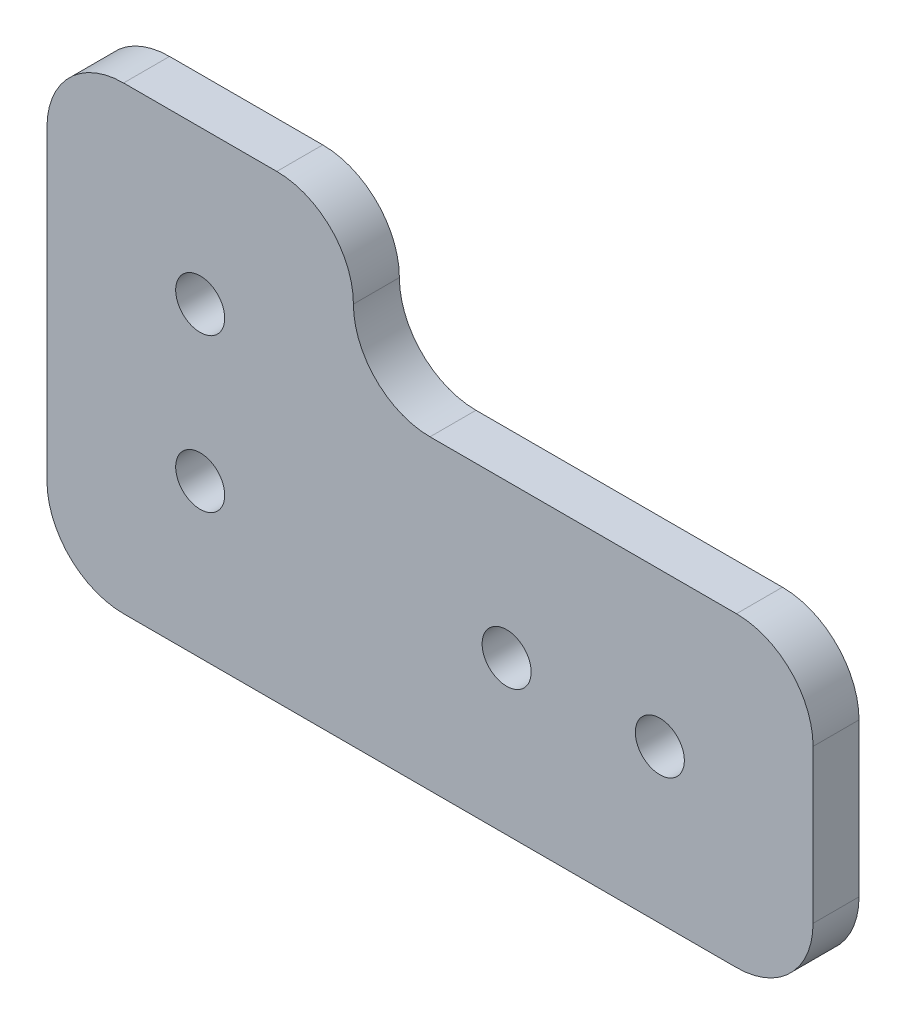
ISO-10303-21;
HEADER;
FILE_DESCRIPTION(('STEP AP214'),'2;1');
FILE_NAME('part.step','',(''),(''),'','','');
FILE_SCHEMA(('AUTOMOTIVE_DESIGN { 1 0 10303 214 1 1 1 1 }'));
ENDSEC;
DATA;
#1=APPLICATION_CONTEXT('core data for automotive mechanical design processes');
#2=APPLICATION_PROTOCOL_DEFINITION('international standard','automotive_design',2000,#1);
#3=PRODUCT_CONTEXT('',#1,'mechanical');
#4=PRODUCT('Part','Part','',(#3));
#5=PRODUCT_RELATED_PRODUCT_CATEGORY('part','',(#4));
#6=PRODUCT_DEFINITION_FORMATION('','',#4);
#7=PRODUCT_DEFINITION_CONTEXT('part definition',#1,'design');
#8=PRODUCT_DEFINITION('design','',#6,#7);
#9=PRODUCT_DEFINITION_SHAPE('','',#8);
#10=(LENGTH_UNIT() NAMED_UNIT(*) SI_UNIT(.MILLI.,.METRE.));
#11=(NAMED_UNIT(*) PLANE_ANGLE_UNIT() SI_UNIT($,.RADIAN.));
#12=(NAMED_UNIT(*) SI_UNIT($,.STERADIAN.) SOLID_ANGLE_UNIT());
#13=UNCERTAINTY_MEASURE_WITH_UNIT(LENGTH_MEASURE(1.E-05),#10,'distance_accuracy_value','');
#14=(GEOMETRIC_REPRESENTATION_CONTEXT(3) GLOBAL_UNCERTAINTY_ASSIGNED_CONTEXT((#13)) GLOBAL_UNIT_ASSIGNED_CONTEXT((#10,
#11,#12)) REPRESENTATION_CONTEXT('',''));
#15=CARTESIAN_POINT('',(0.,0.,0.));
#16=DIRECTION('',(0.,0.,1.));
#17=DIRECTION('',(1.,0.,0.));
#18=AXIS2_PLACEMENT_3D('',#15,#16,#17);
#19=CARTESIAN_POINT('',(0.,0.,3.));
#20=DIRECTION('',(0.,0.,-1.));
#21=DIRECTION('',(-1.,0.,0.));
#22=AXIS2_PLACEMENT_3D('',#19,#20,#21);
#23=PLANE('',#22);
#24=DIRECTION('',(0.,-1.,0.));
#25=VECTOR('',#24,1.);
#26=CARTESIAN_POINT('',(0.,0.,3.));
#27=LINE('',#26,#25);
#28=CARTESIAN_POINT('',(0.,25.,3.));
#29=VERTEX_POINT('',#28);
#30=CARTESIAN_POINT('',(0.,5.,3.));
#31=VERTEX_POINT('',#30);
#32=EDGE_CURVE('E155',#29,#31,#27,.T.);
#33=ORIENTED_EDGE('',*,*,#32,.T.);
#34=CARTESIAN_POINT('',(5.,5.,3.));
#35=DIRECTION('',(0.,0.,-1.));
#36=DIRECTION('',(-1.,0.,0.));
#37=AXIS2_PLACEMENT_3D('',#34,#35,#36);
#38=CIRCLE('',#37,5.);
#39=CARTESIAN_POINT('',(5.,0.,3.));
#40=VERTEX_POINT('',#39);
#41=EDGE_CURVE('E181',#31,#40,#38,.F.);
#42=ORIENTED_EDGE('',*,*,#41,.T.);
#43=DIRECTION('',(1.,0.,0.));
#44=VECTOR('',#43,1.);
#45=CARTESIAN_POINT('',(50.,0.,3.));
#46=LINE('',#45,#44);
#47=CARTESIAN_POINT('',(45.,0.,3.));
#48=VERTEX_POINT('',#47);
#49=EDGE_CURVE('E138',#40,#48,#46,.T.);
#50=ORIENTED_EDGE('',*,*,#49,.T.);
#51=CARTESIAN_POINT('',(45.,4.99999999999998,3.));
#52=DIRECTION('',(0.,0.,-1.));
#53=DIRECTION('',(-1.,0.,0.));
#54=AXIS2_PLACEMENT_3D('',#51,#52,#53);
#55=CIRCLE('',#54,5.);
#56=CARTESIAN_POINT('',(50.,4.99999999999998,3.));
#57=VERTEX_POINT('',#56);
#58=EDGE_CURVE('E179',#48,#57,#55,.F.);
#59=ORIENTED_EDGE('',*,*,#58,.T.);
#60=DIRECTION('',(0.,1.,0.));
#61=VECTOR('',#60,1.);
#62=CARTESIAN_POINT('',(50.,20.,3.));
#63=LINE('',#62,#61);
#64=CARTESIAN_POINT('',(50.,15.,3.));
#65=VERTEX_POINT('',#64);
#66=EDGE_CURVE('E225',#57,#65,#63,.T.);
#67=ORIENTED_EDGE('',*,*,#66,.T.);
#68=CARTESIAN_POINT('',(45.,15.,3.));
#69=DIRECTION('',(0.,0.,-1.));
#70=DIRECTION('',(-1.,0.,0.));
#71=AXIS2_PLACEMENT_3D('',#68,#69,#70);
#72=CIRCLE('',#71,5.);
#73=CARTESIAN_POINT('',(45.,20.,3.));
#74=VERTEX_POINT('',#73);
#75=EDGE_CURVE('E177',#65,#74,#72,.F.);
#76=ORIENTED_EDGE('',*,*,#75,.T.);
#77=DIRECTION('',(-1.,0.,0.));
#78=VECTOR('',#77,1.);
#79=CARTESIAN_POINT('',(20.,20.,3.));
#80=LINE('',#79,#78);
#81=CARTESIAN_POINT('',(25.,20.,3.));
#82=VERTEX_POINT('',#81);
#83=EDGE_CURVE('E213',#74,#82,#80,.T.);
#84=ORIENTED_EDGE('',*,*,#83,.T.);
#85=CARTESIAN_POINT('',(25.,25.,3.));
#86=DIRECTION('',(0.,0.,-1.));
#87=DIRECTION('',(-1.,0.,0.));
#88=AXIS2_PLACEMENT_3D('',#85,#86,#87);
#89=CIRCLE('',#88,5.);
#90=CARTESIAN_POINT('',(20.,25.,3.));
#91=VERTEX_POINT('',#90);
#92=EDGE_CURVE('E11',#82,#91,#89,.T.);
#93=ORIENTED_EDGE('',*,*,#92,.T.);
#94=CARTESIAN_POINT('',(15.,25.,3.));
#95=DIRECTION('',(0.,0.,-1.));
#96=DIRECTION('',(-1.,0.,0.));
#97=AXIS2_PLACEMENT_3D('',#94,#95,#96);
#98=CIRCLE('',#97,5.);
#99=CARTESIAN_POINT('',(15.,30.,3.));
#100=VERTEX_POINT('',#99);
#101=EDGE_CURVE('E56',#91,#100,#98,.F.);
#102=ORIENTED_EDGE('',*,*,#101,.T.);
#103=DIRECTION('',(-1.,0.,0.));
#104=VECTOR('',#103,1.);
#105=CARTESIAN_POINT('',(0.,30.,3.));
#106=LINE('',#105,#104);
#107=CARTESIAN_POINT('',(5.00000000000001,30.,3.));
#108=VERTEX_POINT('',#107);
#109=EDGE_CURVE('E218',#100,#108,#106,.T.);
#110=ORIENTED_EDGE('',*,*,#109,.T.);
#111=CARTESIAN_POINT('',(5.00000000000001,25.,3.));
#112=DIRECTION('',(0.,0.,-1.));
#113=DIRECTION('',(-1.,0.,0.));
#114=AXIS2_PLACEMENT_3D('',#111,#112,#113);
#115=CIRCLE('',#114,5.);
#116=EDGE_CURVE('E174',#108,#29,#115,.F.);
#117=ORIENTED_EDGE('',*,*,#116,.T.);
#118=EDGE_LOOP('',(#33,#42,#50,#59,#67,#76,#84,#93,#102,#110,#117));
#119=FACE_BOUND('',#118,.T.);
#120=CARTESIAN_POINT('',(10.,20.,3.));
#121=DIRECTION('',(0.,0.,1.));
#122=DIRECTION('',(1.,0.,0.));
#123=AXIS2_PLACEMENT_3D('',#120,#121,#122);
#124=CIRCLE('',#123,1.6);
#125=CARTESIAN_POINT('',(11.6,20.,3.));
#126=VERTEX_POINT('',#125);
#127=EDGE_CURVE('E146',#126,#126,#124,.T.);
#128=ORIENTED_EDGE('',*,*,#127,.F.);
#129=EDGE_LOOP('',(#128));
#130=FACE_BOUND('',#129,.T.);
#131=CARTESIAN_POINT('',(10.,10.,3.));
#132=DIRECTION('',(0.,0.,1.));
#133=DIRECTION('',(1.,0.,0.));
#134=AXIS2_PLACEMENT_3D('',#131,#132,#133);
#135=CIRCLE('',#134,1.6);
#136=CARTESIAN_POINT('',(11.6,10.,3.));
#137=VERTEX_POINT('',#136);
#138=EDGE_CURVE('E232',#137,#137,#135,.T.);
#139=ORIENTED_EDGE('',*,*,#138,.F.);
#140=EDGE_LOOP('',(#139));
#141=FACE_BOUND('',#140,.T.);
#142=CARTESIAN_POINT('',(30.,10.,3.));
#143=DIRECTION('',(0.,0.,1.));
#144=DIRECTION('',(1.,0.,0.));
#145=AXIS2_PLACEMENT_3D('',#142,#143,#144);
#146=CIRCLE('',#145,1.6);
#147=CARTESIAN_POINT('',(31.6,10.,3.));
#148=VERTEX_POINT('',#147);
#149=EDGE_CURVE('E237',#148,#148,#146,.T.);
#150=ORIENTED_EDGE('',*,*,#149,.F.);
#151=EDGE_LOOP('',(#150));
#152=FACE_BOUND('',#151,.T.);
#153=CARTESIAN_POINT('',(40.,10.,3.));
#154=DIRECTION('',(0.,0.,1.));
#155=DIRECTION('',(1.,0.,0.));
#156=AXIS2_PLACEMENT_3D('',#153,#154,#155);
#157=CIRCLE('',#156,1.6);
#158=CARTESIAN_POINT('',(41.6,10.,3.));
#159=VERTEX_POINT('',#158);
#160=EDGE_CURVE('E243',#159,#159,#157,.T.);
#161=ORIENTED_EDGE('',*,*,#160,.F.);
#162=EDGE_LOOP('',(#161));
#163=FACE_BOUND('',#162,.T.);
#164=ADVANCED_FACE('F34',(#119,#130,#141,#152,#163),#23,.F.);
#165=CARTESIAN_POINT('',(0.,0.,0.));
#166=DIRECTION('',(0.,0.,-1.));
#167=DIRECTION('',(-1.,0.,0.));
#168=AXIS2_PLACEMENT_3D('',#165,#166,#167);
#169=PLANE('',#168);
#170=CARTESIAN_POINT('',(30.,10.,0.));
#171=DIRECTION('',(0.,0.,1.));
#172=DIRECTION('',(1.,0.,0.));
#173=AXIS2_PLACEMENT_3D('',#170,#171,#172);
#174=CIRCLE('',#173,1.6);
#175=CARTESIAN_POINT('',(31.6,10.,0.));
#176=VERTEX_POINT('',#175);
#177=EDGE_CURVE('E240',#176,#176,#174,.T.);
#178=ORIENTED_EDGE('',*,*,#177,.T.);
#179=EDGE_LOOP('',(#178));
#180=FACE_BOUND('',#179,.T.);
#181=CARTESIAN_POINT('',(10.,20.,0.));
#182=DIRECTION('',(0.,0.,1.));
#183=DIRECTION('',(1.,0.,0.));
#184=AXIS2_PLACEMENT_3D('',#181,#182,#183);
#185=CIRCLE('',#184,1.6);
#186=CARTESIAN_POINT('',(11.6,20.,0.));
#187=VERTEX_POINT('',#186);
#188=EDGE_CURVE('E152',#187,#187,#185,.T.);
#189=ORIENTED_EDGE('',*,*,#188,.T.);
#190=EDGE_LOOP('',(#189));
#191=FACE_BOUND('',#190,.T.);
#192=DIRECTION('',(1.,0.,0.));
#193=VECTOR('',#192,1.);
#194=CARTESIAN_POINT('',(50.,0.,0.));
#195=LINE('',#194,#193);
#196=CARTESIAN_POINT('',(5.,0.,0.));
#197=VERTEX_POINT('',#196);
#198=CARTESIAN_POINT('',(45.,0.,0.));
#199=VERTEX_POINT('',#198);
#200=EDGE_CURVE('E135',#197,#199,#195,.T.);
#201=ORIENTED_EDGE('',*,*,#200,.F.);
#202=CARTESIAN_POINT('',(5.,5.,0.));
#203=DIRECTION('',(0.,0.,-1.));
#204=DIRECTION('',(-1.,0.,0.));
#205=AXIS2_PLACEMENT_3D('',#202,#203,#204);
#206=CIRCLE('',#205,5.);
#207=CARTESIAN_POINT('',(0.,5.,0.));
#208=VERTEX_POINT('',#207);
#209=EDGE_CURVE('E118',#197,#208,#206,.T.);
#210=ORIENTED_EDGE('',*,*,#209,.T.);
#211=DIRECTION('',(0.,-1.,0.));
#212=VECTOR('',#211,1.);
#213=CARTESIAN_POINT('',(0.,0.,0.));
#214=LINE('',#213,#212);
#215=CARTESIAN_POINT('',(0.,25.,0.));
#216=VERTEX_POINT('',#215);
#217=EDGE_CURVE('E162',#216,#208,#214,.T.);
#218=ORIENTED_EDGE('',*,*,#217,.F.);
#219=CARTESIAN_POINT('',(5.00000000000001,25.,0.));
#220=DIRECTION('',(0.,0.,-1.));
#221=DIRECTION('',(-1.,0.,0.));
#222=AXIS2_PLACEMENT_3D('',#219,#220,#221);
#223=CIRCLE('',#222,5.);
#224=CARTESIAN_POINT('',(5.00000000000001,30.,0.));
#225=VERTEX_POINT('',#224);
#226=EDGE_CURVE('E139',#216,#225,#223,.T.);
#227=ORIENTED_EDGE('',*,*,#226,.T.);
#228=DIRECTION('',(-1.,0.,0.));
#229=VECTOR('',#228,1.);
#230=CARTESIAN_POINT('',(0.,30.,0.));
#231=LINE('',#230,#229);
#232=CARTESIAN_POINT('',(15.,30.,0.));
#233=VERTEX_POINT('',#232);
#234=EDGE_CURVE('E160',#233,#225,#231,.T.);
#235=ORIENTED_EDGE('',*,*,#234,.F.);
#236=CARTESIAN_POINT('',(15.,25.,0.));
#237=DIRECTION('',(0.,0.,-1.));
#238=DIRECTION('',(-1.,0.,0.));
#239=AXIS2_PLACEMENT_3D('',#236,#237,#238);
#240=CIRCLE('',#239,5.);
#241=CARTESIAN_POINT('',(20.,25.,0.));
#242=VERTEX_POINT('',#241);
#243=EDGE_CURVE('E166',#233,#242,#240,.T.);
#244=ORIENTED_EDGE('',*,*,#243,.T.);
#245=CARTESIAN_POINT('',(25.,25.,0.));
#246=DIRECTION('',(0.,0.,-1.));
#247=DIRECTION('',(-1.,0.,0.));
#248=AXIS2_PLACEMENT_3D('',#245,#246,#247);
#249=CIRCLE('',#248,5.);
#250=CARTESIAN_POINT('',(25.,20.,0.));
#251=VERTEX_POINT('',#250);
#252=EDGE_CURVE('E43',#242,#251,#249,.F.);
#253=ORIENTED_EDGE('',*,*,#252,.T.);
#254=DIRECTION('',(-1.,0.,0.));
#255=VECTOR('',#254,1.);
#256=CARTESIAN_POINT('',(20.,20.,0.));
#257=LINE('',#256,#255);
#258=CARTESIAN_POINT('',(45.,20.,0.));
#259=VERTEX_POINT('',#258);
#260=EDGE_CURVE('E149',#259,#251,#257,.T.);
#261=ORIENTED_EDGE('',*,*,#260,.F.);
#262=CARTESIAN_POINT('',(45.,15.,0.));
#263=DIRECTION('',(0.,0.,-1.));
#264=DIRECTION('',(-1.,0.,0.));
#265=AXIS2_PLACEMENT_3D('',#262,#263,#264);
#266=CIRCLE('',#265,5.);
#267=CARTESIAN_POINT('',(50.,15.,0.));
#268=VERTEX_POINT('',#267);
#269=EDGE_CURVE('E168',#259,#268,#266,.T.);
#270=ORIENTED_EDGE('',*,*,#269,.T.);
#271=DIRECTION('',(0.,1.,0.));
#272=VECTOR('',#271,1.);
#273=CARTESIAN_POINT('',(50.,20.,0.));
#274=LINE('',#273,#272);
#275=CARTESIAN_POINT('',(50.,4.99999999999998,0.));
#276=VERTEX_POINT('',#275);
#277=EDGE_CURVE('E145',#276,#268,#274,.T.);
#278=ORIENTED_EDGE('',*,*,#277,.F.);
#279=CARTESIAN_POINT('',(45.,4.99999999999998,0.));
#280=DIRECTION('',(0.,0.,-1.));
#281=DIRECTION('',(-1.,0.,0.));
#282=AXIS2_PLACEMENT_3D('',#279,#280,#281);
#283=CIRCLE('',#282,5.);
#284=EDGE_CURVE('E129',#276,#199,#283,.T.);
#285=ORIENTED_EDGE('',*,*,#284,.T.);
#286=EDGE_LOOP('',(#201,#210,#218,#227,#235,#244,#253,#261,#270,#278,#285));
#287=FACE_BOUND('',#286,.T.);
#288=CARTESIAN_POINT('',(10.,10.,0.));
#289=DIRECTION('',(0.,0.,1.));
#290=DIRECTION('',(1.,0.,0.));
#291=AXIS2_PLACEMENT_3D('',#288,#289,#290);
#292=CIRCLE('',#291,1.6);
#293=CARTESIAN_POINT('',(11.6,10.,0.));
#294=VERTEX_POINT('',#293);
#295=EDGE_CURVE('E234',#294,#294,#292,.T.);
#296=ORIENTED_EDGE('',*,*,#295,.T.);
#297=EDGE_LOOP('',(#296));
#298=FACE_BOUND('',#297,.T.);
#299=CARTESIAN_POINT('',(40.,10.,0.));
#300=DIRECTION('',(0.,0.,1.));
#301=DIRECTION('',(1.,0.,0.));
#302=AXIS2_PLACEMENT_3D('',#299,#300,#301);
#303=CIRCLE('',#302,1.6);
#304=CARTESIAN_POINT('',(41.6,10.,0.));
#305=VERTEX_POINT('',#304);
#306=EDGE_CURVE('E246',#305,#305,#303,.T.);
#307=ORIENTED_EDGE('',*,*,#306,.T.);
#308=EDGE_LOOP('',(#307));
#309=FACE_BOUND('',#308,.T.);
#310=ADVANCED_FACE('F142',(#180,#191,#287,#298,#309),#169,.T.);
#311=CARTESIAN_POINT('',(50.,0.,3.));
#312=DIRECTION('',(0.,1.,0.));
#313=DIRECTION('',(-1.,0.,0.));
#314=AXIS2_PLACEMENT_3D('',#311,#312,#313);
#315=PLANE('',#314);
#316=ORIENTED_EDGE('',*,*,#49,.F.);
#317=DIRECTION('',(0.,0.,-1.));
#318=VECTOR('',#317,1.);
#319=CARTESIAN_POINT('',(5.,0.,3.));
#320=LINE('',#319,#318);
#321=EDGE_CURVE('E122',#40,#197,#320,.T.);
#322=ORIENTED_EDGE('',*,*,#321,.T.);
#323=ORIENTED_EDGE('',*,*,#200,.T.);
#324=DIRECTION('',(0.,0.,-1.));
#325=VECTOR('',#324,1.);
#326=CARTESIAN_POINT('',(45.,0.,3.));
#327=LINE('',#326,#325);
#328=EDGE_CURVE('E140',#199,#48,#327,.F.);
#329=ORIENTED_EDGE('',*,*,#328,.T.);
#330=EDGE_LOOP('',(#316,#322,#323,#329));
#331=FACE_BOUND('',#330,.T.);
#332=ADVANCED_FACE('F134',(#331),#315,.F.);
#333=CARTESIAN_POINT('',(50.,20.,3.));
#334=DIRECTION('',(-1.,0.,0.));
#335=DIRECTION('',(0.,-1.,0.));
#336=AXIS2_PLACEMENT_3D('',#333,#334,#335);
#337=PLANE('',#336);
#338=ORIENTED_EDGE('',*,*,#66,.F.);
#339=DIRECTION('',(0.,0.,-1.));
#340=VECTOR('',#339,1.);
#341=CARTESIAN_POINT('',(50.,4.99999999999998,3.));
#342=LINE('',#341,#340);
#343=EDGE_CURVE('E185',#57,#276,#342,.T.);
#344=ORIENTED_EDGE('',*,*,#343,.T.);
#345=ORIENTED_EDGE('',*,*,#277,.T.);
#346=DIRECTION('',(0.,0.,-1.));
#347=VECTOR('',#346,1.);
#348=CARTESIAN_POINT('',(50.,15.,3.));
#349=LINE('',#348,#347);
#350=EDGE_CURVE('E183',#268,#65,#349,.F.);
#351=ORIENTED_EDGE('',*,*,#350,.T.);
#352=EDGE_LOOP('',(#338,#344,#345,#351));
#353=FACE_BOUND('',#352,.T.);
#354=ADVANCED_FACE('F272',(#353),#337,.F.);
#355=CARTESIAN_POINT('',(20.,20.,3.));
#356=DIRECTION('',(0.,-1.,0.));
#357=DIRECTION('',(0.,0.,-1.));
#358=AXIS2_PLACEMENT_3D('',#355,#356,#357);
#359=PLANE('',#358);
#360=ORIENTED_EDGE('',*,*,#83,.F.);
#361=DIRECTION('',(0.,0.,-1.));
#362=VECTOR('',#361,1.);
#363=CARTESIAN_POINT('',(45.,20.,3.));
#364=LINE('',#363,#362);
#365=EDGE_CURVE('E191',#74,#259,#364,.T.);
#366=ORIENTED_EDGE('',*,*,#365,.T.);
#367=ORIENTED_EDGE('',*,*,#260,.T.);
#368=DIRECTION('',(0.,0.,-1.));
#369=VECTOR('',#368,1.);
#370=CARTESIAN_POINT('',(25.,20.,3.));
#371=LINE('',#370,#369);
#372=EDGE_CURVE('E188',#251,#82,#371,.F.);
#373=ORIENTED_EDGE('',*,*,#372,.T.);
#374=EDGE_LOOP('',(#360,#366,#367,#373));
#375=FACE_BOUND('',#374,.T.);
#376=ADVANCED_FACE('F207',(#375),#359,.F.);
#377=CARTESIAN_POINT('',(0.,30.,3.));
#378=DIRECTION('',(0.,-1.,0.));
#379=DIRECTION('',(0.,0.,-1.));
#380=AXIS2_PLACEMENT_3D('',#377,#378,#379);
#381=PLANE('',#380);
#382=ORIENTED_EDGE('',*,*,#109,.F.);
#383=DIRECTION('',(0.,0.,-1.));
#384=VECTOR('',#383,1.);
#385=CARTESIAN_POINT('',(15.,30.,3.));
#386=LINE('',#385,#384);
#387=EDGE_CURVE('E195',#100,#233,#386,.T.);
#388=ORIENTED_EDGE('',*,*,#387,.T.);
#389=ORIENTED_EDGE('',*,*,#234,.T.);
#390=DIRECTION('',(0.,0.,-1.));
#391=VECTOR('',#390,1.);
#392=CARTESIAN_POINT('',(5.00000000000001,30.,3.));
#393=LINE('',#392,#391);
#394=EDGE_CURVE('E50',#225,#108,#393,.F.);
#395=ORIENTED_EDGE('',*,*,#394,.T.);
#396=EDGE_LOOP('',(#382,#388,#389,#395));
#397=FACE_BOUND('',#396,.T.);
#398=ADVANCED_FACE('F217',(#397),#381,.F.);
#399=CARTESIAN_POINT('',(0.,0.,3.));
#400=DIRECTION('',(1.,0.,0.));
#401=DIRECTION('',(0.,1.,0.));
#402=AXIS2_PLACEMENT_3D('',#399,#400,#401);
#403=PLANE('',#402);
#404=ORIENTED_EDGE('',*,*,#217,.T.);
#405=DIRECTION('',(0.,0.,-1.));
#406=VECTOR('',#405,1.);
#407=CARTESIAN_POINT('',(0.,5.,3.));
#408=LINE('',#407,#406);
#409=EDGE_CURVE('E123',#208,#31,#408,.F.);
#410=ORIENTED_EDGE('',*,*,#409,.T.);
#411=ORIENTED_EDGE('',*,*,#32,.F.);
#412=DIRECTION('',(0.,0.,-1.));
#413=VECTOR('',#412,1.);
#414=CARTESIAN_POINT('',(0.,25.,3.));
#415=LINE('',#414,#413);
#416=EDGE_CURVE('E128',#29,#216,#415,.T.);
#417=ORIENTED_EDGE('',*,*,#416,.T.);
#418=EDGE_LOOP('',(#404,#410,#411,#417));
#419=FACE_BOUND('',#418,.T.);
#420=ADVANCED_FACE('F224',(#419),#403,.F.);
#421=CARTESIAN_POINT('',(10.,20.,3.));
#422=DIRECTION('',(0.,0.,-1.));
#423=DIRECTION('',(-1.,0.,0.));
#424=AXIS2_PLACEMENT_3D('',#421,#422,#423);
#425=CYLINDRICAL_SURFACE('',#424,1.6);
#426=ORIENTED_EDGE('',*,*,#127,.T.);
#427=EDGE_LOOP('',(#426));
#428=FACE_BOUND('',#427,.T.);
#429=ORIENTED_EDGE('',*,*,#188,.F.);
#430=EDGE_LOOP('',(#429));
#431=FACE_BOUND('',#430,.T.);
#432=ADVANCED_FACE('F263',(#428,#431),#425,.F.);
#433=CARTESIAN_POINT('',(10.,10.,3.));
#434=DIRECTION('',(0.,0.,-1.));
#435=DIRECTION('',(-1.,0.,0.));
#436=AXIS2_PLACEMENT_3D('',#433,#434,#435);
#437=CYLINDRICAL_SURFACE('',#436,1.6);
#438=ORIENTED_EDGE('',*,*,#138,.T.);
#439=EDGE_LOOP('',(#438));
#440=FACE_BOUND('',#439,.T.);
#441=ORIENTED_EDGE('',*,*,#295,.F.);
#442=EDGE_LOOP('',(#441));
#443=FACE_BOUND('',#442,.T.);
#444=ADVANCED_FACE('F340',(#440,#443),#437,.F.);
#445=CARTESIAN_POINT('',(30.,10.,3.));
#446=DIRECTION('',(0.,0.,-1.));
#447=DIRECTION('',(-1.,0.,0.));
#448=AXIS2_PLACEMENT_3D('',#445,#446,#447);
#449=CYLINDRICAL_SURFACE('',#448,1.6);
#450=ORIENTED_EDGE('',*,*,#149,.T.);
#451=EDGE_LOOP('',(#450));
#452=FACE_BOUND('',#451,.T.);
#453=ORIENTED_EDGE('',*,*,#177,.F.);
#454=EDGE_LOOP('',(#453));
#455=FACE_BOUND('',#454,.T.);
#456=ADVANCED_FACE('F332',(#452,#455),#449,.F.);
#457=CARTESIAN_POINT('',(40.,10.,3.));
#458=DIRECTION('',(0.,0.,-1.));
#459=DIRECTION('',(-1.,0.,0.));
#460=AXIS2_PLACEMENT_3D('',#457,#458,#459);
#461=CYLINDRICAL_SURFACE('',#460,1.6);
#462=ORIENTED_EDGE('',*,*,#160,.T.);
#463=EDGE_LOOP('',(#462));
#464=FACE_BOUND('',#463,.T.);
#465=ORIENTED_EDGE('',*,*,#306,.F.);
#466=EDGE_LOOP('',(#465));
#467=FACE_BOUND('',#466,.T.);
#468=ADVANCED_FACE('F252',(#464,#467),#461,.F.);
#469=CARTESIAN_POINT('',(5.,5.,3.));
#470=DIRECTION('',(0.,0.,-1.));
#471=DIRECTION('',(-1.,0.,0.));
#472=AXIS2_PLACEMENT_3D('',#469,#470,#471);
#473=CYLINDRICAL_SURFACE('',#472,5.);
#474=ORIENTED_EDGE('',*,*,#41,.F.);
#475=ORIENTED_EDGE('',*,*,#409,.F.);
#476=ORIENTED_EDGE('',*,*,#209,.F.);
#477=ORIENTED_EDGE('',*,*,#321,.F.);
#478=EDGE_LOOP('',(#474,#475,#476,#477));
#479=FACE_BOUND('',#478,.T.);
#480=ADVANCED_FACE('F121',(#479),#473,.T.);
#481=CARTESIAN_POINT('',(45.,4.99999999999998,3.));
#482=DIRECTION('',(0.,0.,-1.));
#483=DIRECTION('',(-1.,0.,0.));
#484=AXIS2_PLACEMENT_3D('',#481,#482,#483);
#485=CYLINDRICAL_SURFACE('',#484,5.);
#486=ORIENTED_EDGE('',*,*,#58,.F.);
#487=ORIENTED_EDGE('',*,*,#328,.F.);
#488=ORIENTED_EDGE('',*,*,#284,.F.);
#489=ORIENTED_EDGE('',*,*,#343,.F.);
#490=EDGE_LOOP('',(#486,#487,#488,#489));
#491=FACE_BOUND('',#490,.T.);
#492=ADVANCED_FACE('F280',(#491),#485,.T.);
#493=CARTESIAN_POINT('',(45.,15.,3.));
#494=DIRECTION('',(0.,0.,-1.));
#495=DIRECTION('',(-1.,0.,0.));
#496=AXIS2_PLACEMENT_3D('',#493,#494,#495);
#497=CYLINDRICAL_SURFACE('',#496,5.);
#498=ORIENTED_EDGE('',*,*,#75,.F.);
#499=ORIENTED_EDGE('',*,*,#350,.F.);
#500=ORIENTED_EDGE('',*,*,#269,.F.);
#501=ORIENTED_EDGE('',*,*,#365,.F.);
#502=EDGE_LOOP('',(#498,#499,#500,#501));
#503=FACE_BOUND('',#502,.T.);
#504=ADVANCED_FACE('F283',(#503),#497,.T.);
#505=CARTESIAN_POINT('',(15.,25.,3.));
#506=DIRECTION('',(0.,0.,-1.));
#507=DIRECTION('',(-1.,0.,0.));
#508=AXIS2_PLACEMENT_3D('',#505,#506,#507);
#509=CYLINDRICAL_SURFACE('',#508,5.);
#510=ORIENTED_EDGE('',*,*,#387,.F.);
#511=ORIENTED_EDGE('',*,*,#101,.F.);
#512=DIRECTION('',(0.,0.,-1.));
#513=VECTOR('',#512,1.);
#514=CARTESIAN_POINT('',(20.,25.,3.));
#515=LINE('',#514,#513);
#516=EDGE_CURVE('E38',#242,#91,#515,.F.);
#517=ORIENTED_EDGE('',*,*,#516,.F.);
#518=ORIENTED_EDGE('',*,*,#243,.F.);
#519=EDGE_LOOP('',(#510,#511,#517,#518));
#520=FACE_BOUND('',#519,.T.);
#521=ADVANCED_FACE('F216',(#520),#509,.T.);
#522=CARTESIAN_POINT('',(25.,25.,3.));
#523=DIRECTION('',(0.,0.,1.));
#524=DIRECTION('',(1.,0.,0.));
#525=AXIS2_PLACEMENT_3D('',#522,#523,#524);
#526=CYLINDRICAL_SURFACE('',#525,5.);
#527=ORIENTED_EDGE('',*,*,#92,.F.);
#528=ORIENTED_EDGE('',*,*,#372,.F.);
#529=ORIENTED_EDGE('',*,*,#252,.F.);
#530=ORIENTED_EDGE('',*,*,#516,.T.);
#531=EDGE_LOOP('',(#527,#528,#529,#530));
#532=FACE_BOUND('',#531,.T.);
#533=ADVANCED_FACE('F210',(#532),#526,.F.);
#534=CARTESIAN_POINT('',(5.00000000000001,25.,3.));
#535=DIRECTION('',(0.,0.,-1.));
#536=DIRECTION('',(-1.,0.,0.));
#537=AXIS2_PLACEMENT_3D('',#534,#535,#536);
#538=CYLINDRICAL_SURFACE('',#537,5.);
#539=ORIENTED_EDGE('',*,*,#116,.F.);
#540=ORIENTED_EDGE('',*,*,#394,.F.);
#541=ORIENTED_EDGE('',*,*,#226,.F.);
#542=ORIENTED_EDGE('',*,*,#416,.F.);
#543=EDGE_LOOP('',(#539,#540,#541,#542));
#544=FACE_BOUND('',#543,.T.);
#545=ADVANCED_FACE('F36',(#544),#538,.T.);
#546=CLOSED_SHELL('',(#164,#310,#332,#354,#376,#398,#420,#432,#444,#456,#468,#480,#492,#504,
#521,#533,#545));
#547=MANIFOLD_SOLID_BREP('B2',#546);
#548=ADVANCED_BREP_SHAPE_REPRESENTATION('',(#18,#547),#14);
#549=SHAPE_DEFINITION_REPRESENTATION(#9,#548);
ENDSEC;
END-ISO-10303-21;
